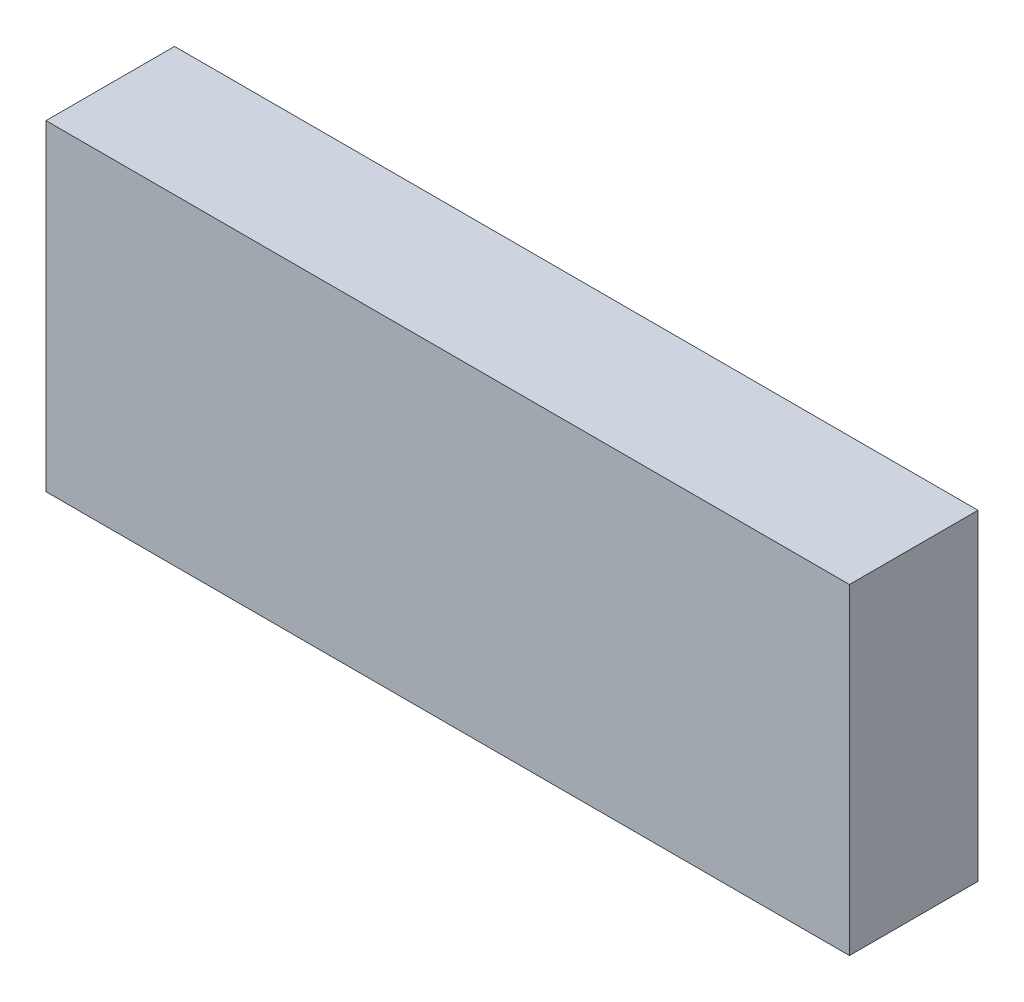
ISO-10303-21;
HEADER;
FILE_DESCRIPTION(('STEP AP214'),'2;1');
FILE_NAME('part.step','',(''),(''),'','','');
FILE_SCHEMA(('AUTOMOTIVE_DESIGN { 1 0 10303 214 1 1 1 1 }'));
ENDSEC;
DATA;
#1=APPLICATION_CONTEXT('core data for automotive mechanical design processes');
#2=APPLICATION_PROTOCOL_DEFINITION('international standard','automotive_design',2000,#1);
#3=PRODUCT_CONTEXT('',#1,'mechanical');
#4=PRODUCT('Part','Part','',(#3));
#5=PRODUCT_RELATED_PRODUCT_CATEGORY('part','',(#4));
#6=PRODUCT_DEFINITION_FORMATION('','',#4);
#7=PRODUCT_DEFINITION_CONTEXT('part definition',#1,'design');
#8=PRODUCT_DEFINITION('design','',#6,#7);
#9=PRODUCT_DEFINITION_SHAPE('','',#8);
#10=(LENGTH_UNIT() NAMED_UNIT(*) SI_UNIT(.MILLI.,.METRE.));
#11=(NAMED_UNIT(*) PLANE_ANGLE_UNIT() SI_UNIT($,.RADIAN.));
#12=(NAMED_UNIT(*) SI_UNIT($,.STERADIAN.) SOLID_ANGLE_UNIT());
#13=UNCERTAINTY_MEASURE_WITH_UNIT(LENGTH_MEASURE(1.E-05),#10,'distance_accuracy_value','');
#14=(GEOMETRIC_REPRESENTATION_CONTEXT(3) GLOBAL_UNCERTAINTY_ASSIGNED_CONTEXT((#13)) GLOBAL_UNIT_ASSIGNED_CONTEXT((#10,
#11,#12)) REPRESENTATION_CONTEXT('',''));
#15=CARTESIAN_POINT('',(0.,0.,0.));
#16=DIRECTION('',(0.,0.,1.));
#17=DIRECTION('',(1.,0.,0.));
#18=AXIS2_PLACEMENT_3D('',#15,#16,#17);
#19=CARTESIAN_POINT('',(-12.5,-5.,4.));
#20=DIRECTION('',(1.,0.,0.));
#21=DIRECTION('',(0.,0.,-1.));
#22=AXIS2_PLACEMENT_3D('',#19,#20,#21);
#23=PLANE('',#22);
#24=DIRECTION('',(0.,-1.,0.));
#25=VECTOR('',#24,1.);
#26=CARTESIAN_POINT('',(-12.5,-5.,0.));
#27=LINE('',#26,#25);
#28=CARTESIAN_POINT('',(-12.5,5.,0.));
#29=VERTEX_POINT('',#28);
#30=CARTESIAN_POINT('',(-12.5,-5.,0.));
#31=VERTEX_POINT('',#30);
#32=EDGE_CURVE('E112',#29,#31,#27,.T.);
#33=ORIENTED_EDGE('',*,*,#32,.T.);
#34=DIRECTION('',(0.,0.,-1.));
#35=VECTOR('',#34,1.);
#36=CARTESIAN_POINT('',(-12.5,-5.,4.));
#37=LINE('',#36,#35);
#38=CARTESIAN_POINT('',(-12.5,-5.,4.));
#39=VERTEX_POINT('',#38);
#40=EDGE_CURVE('E11',#39,#31,#37,.T.);
#41=ORIENTED_EDGE('',*,*,#40,.F.);
#42=DIRECTION('',(0.,-1.,0.));
#43=VECTOR('',#42,1.);
#44=CARTESIAN_POINT('',(-12.5,-5.,4.));
#45=LINE('',#44,#43);
#46=CARTESIAN_POINT('',(-12.5,5.,4.));
#47=VERTEX_POINT('',#46);
#48=EDGE_CURVE('E96',#47,#39,#45,.T.);
#49=ORIENTED_EDGE('',*,*,#48,.F.);
#50=DIRECTION('',(0.,0.,-1.));
#51=VECTOR('',#50,1.);
#52=CARTESIAN_POINT('',(-12.5,5.,4.));
#53=LINE('',#52,#51);
#54=EDGE_CURVE('E108',#47,#29,#53,.T.);
#55=ORIENTED_EDGE('',*,*,#54,.T.);
#56=EDGE_LOOP('',(#33,#41,#49,#55));
#57=FACE_BOUND('',#56,.T.);
#58=ADVANCED_FACE('F44',(#57),#23,.F.);
#59=CARTESIAN_POINT('',(12.5,-5.,4.));
#60=DIRECTION('',(0.,1.,0.));
#61=DIRECTION('',(-1.,0.,0.));
#62=AXIS2_PLACEMENT_3D('',#59,#60,#61);
#63=PLANE('',#62);
#64=DIRECTION('',(1.,0.,0.));
#65=VECTOR('',#64,1.);
#66=CARTESIAN_POINT('',(12.5,-5.,0.));
#67=LINE('',#66,#65);
#68=CARTESIAN_POINT('',(12.5,-5.,0.));
#69=VERTEX_POINT('',#68);
#70=EDGE_CURVE('E101',#31,#69,#67,.T.);
#71=ORIENTED_EDGE('',*,*,#70,.T.);
#72=DIRECTION('',(0.,0.,-1.));
#73=VECTOR('',#72,1.);
#74=CARTESIAN_POINT('',(12.5,-5.,4.));
#75=LINE('',#74,#73);
#76=CARTESIAN_POINT('',(12.5,-5.,4.));
#77=VERTEX_POINT('',#76);
#78=EDGE_CURVE('E53',#77,#69,#75,.T.);
#79=ORIENTED_EDGE('',*,*,#78,.F.);
#80=DIRECTION('',(1.,0.,0.));
#81=VECTOR('',#80,1.);
#82=CARTESIAN_POINT('',(12.5,-5.,4.));
#83=LINE('',#82,#81);
#84=EDGE_CURVE('E91',#39,#77,#83,.T.);
#85=ORIENTED_EDGE('',*,*,#84,.F.);
#86=ORIENTED_EDGE('',*,*,#40,.T.);
#87=EDGE_LOOP('',(#71,#79,#85,#86));
#88=FACE_BOUND('',#87,.T.);
#89=ADVANCED_FACE('F100',(#88),#63,.F.);
#90=CARTESIAN_POINT('',(12.5,-5.,4.));
#91=DIRECTION('',(-1.,0.,0.));
#92=DIRECTION('',(0.,-1.,0.));
#93=AXIS2_PLACEMENT_3D('',#90,#91,#92);
#94=PLANE('',#93);
#95=DIRECTION('',(0.,1.,0.));
#96=VECTOR('',#95,1.);
#97=CARTESIAN_POINT('',(12.5,-5.,0.));
#98=LINE('',#97,#96);
#99=CARTESIAN_POINT('',(12.5,5.,0.));
#100=VERTEX_POINT('',#99);
#101=EDGE_CURVE('E78',#69,#100,#98,.T.);
#102=ORIENTED_EDGE('',*,*,#101,.T.);
#103=DIRECTION('',(0.,0.,-1.));
#104=VECTOR('',#103,1.);
#105=CARTESIAN_POINT('',(12.5,5.,4.));
#106=LINE('',#105,#104);
#107=CARTESIAN_POINT('',(12.5,5.,4.));
#108=VERTEX_POINT('',#107);
#109=EDGE_CURVE('E103',#108,#100,#106,.T.);
#110=ORIENTED_EDGE('',*,*,#109,.F.);
#111=DIRECTION('',(0.,1.,0.));
#112=VECTOR('',#111,1.);
#113=CARTESIAN_POINT('',(12.5,-5.,4.));
#114=LINE('',#113,#112);
#115=EDGE_CURVE('E94',#77,#108,#114,.T.);
#116=ORIENTED_EDGE('',*,*,#115,.F.);
#117=ORIENTED_EDGE('',*,*,#78,.T.);
#118=EDGE_LOOP('',(#102,#110,#116,#117));
#119=FACE_BOUND('',#118,.T.);
#120=ADVANCED_FACE('F104',(#119),#94,.F.);
#121=CARTESIAN_POINT('',(12.5,5.,4.));
#122=DIRECTION('',(0.,-1.,0.));
#123=DIRECTION('',(1.,0.,0.));
#124=AXIS2_PLACEMENT_3D('',#121,#122,#123);
#125=PLANE('',#124);
#126=DIRECTION('',(-1.,0.,0.));
#127=VECTOR('',#126,1.);
#128=CARTESIAN_POINT('',(12.5,5.,0.));
#129=LINE('',#128,#127);
#130=EDGE_CURVE('E84',#100,#29,#129,.T.);
#131=ORIENTED_EDGE('',*,*,#130,.T.);
#132=ORIENTED_EDGE('',*,*,#54,.F.);
#133=DIRECTION('',(-1.,0.,0.));
#134=VECTOR('',#133,1.);
#135=CARTESIAN_POINT('',(12.5,5.,4.));
#136=LINE('',#135,#134);
#137=EDGE_CURVE('E61',#108,#47,#136,.T.);
#138=ORIENTED_EDGE('',*,*,#137,.F.);
#139=ORIENTED_EDGE('',*,*,#109,.T.);
#140=EDGE_LOOP('',(#131,#132,#138,#139));
#141=FACE_BOUND('',#140,.T.);
#142=ADVANCED_FACE('F125',(#141),#125,.F.);
#143=CARTESIAN_POINT('',(0.,0.,4.));
#144=DIRECTION('',(0.,0.,1.));
#145=DIRECTION('',(1.,0.,0.));
#146=AXIS2_PLACEMENT_3D('',#143,#144,#145);
#147=PLANE('',#146);
#148=ORIENTED_EDGE('',*,*,#48,.T.);
#149=ORIENTED_EDGE('',*,*,#84,.T.);
#150=ORIENTED_EDGE('',*,*,#115,.T.);
#151=ORIENTED_EDGE('',*,*,#137,.T.);
#152=EDGE_LOOP('',(#148,#149,#150,#151));
#153=FACE_BOUND('',#152,.T.);
#154=ADVANCED_FACE('F92',(#153),#147,.T.);
#155=CARTESIAN_POINT('',(0.,0.,0.));
#156=DIRECTION('',(0.,0.,1.));
#157=DIRECTION('',(1.,0.,0.));
#158=AXIS2_PLACEMENT_3D('',#155,#156,#157);
#159=PLANE('',#158);
#160=ORIENTED_EDGE('',*,*,#32,.F.);
#161=ORIENTED_EDGE('',*,*,#130,.F.);
#162=ORIENTED_EDGE('',*,*,#101,.F.);
#163=ORIENTED_EDGE('',*,*,#70,.F.);
#164=EDGE_LOOP('',(#160,#161,#162,#163));
#165=FACE_BOUND('',#164,.T.);
#166=ADVANCED_FACE('F128',(#165),#159,.F.);
#167=CLOSED_SHELL('',(#58,#89,#120,#142,#154,#166));
#168=MANIFOLD_SOLID_BREP('B2',#167);
#169=ADVANCED_BREP_SHAPE_REPRESENTATION('',(#18,#168),#14);
#170=SHAPE_DEFINITION_REPRESENTATION(#9,#169);
ENDSEC;
END-ISO-10303-21;
